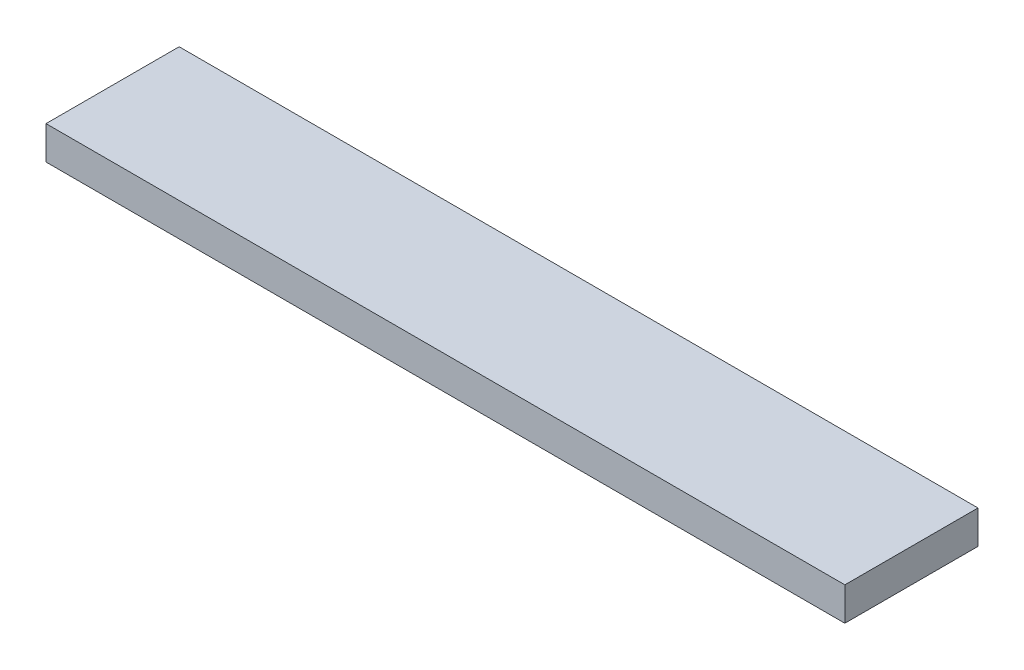
ISO-10303-21;
HEADER;
FILE_DESCRIPTION(('STEP AP214'),'2;1');
FILE_NAME('part.step','',(''),(''),'','','');
FILE_SCHEMA(('AUTOMOTIVE_DESIGN { 1 0 10303 214 1 1 1 1 }'));
ENDSEC;
DATA;
#1=APPLICATION_CONTEXT('core data for automotive mechanical design processes');
#2=APPLICATION_PROTOCOL_DEFINITION('international standard','automotive_design',2000,#1);
#3=PRODUCT_CONTEXT('',#1,'mechanical');
#4=PRODUCT('Part','Part','',(#3));
#5=PRODUCT_RELATED_PRODUCT_CATEGORY('part','',(#4));
#6=PRODUCT_DEFINITION_FORMATION('','',#4);
#7=PRODUCT_DEFINITION_CONTEXT('part definition',#1,'design');
#8=PRODUCT_DEFINITION('design','',#6,#7);
#9=PRODUCT_DEFINITION_SHAPE('','',#8);
#10=(LENGTH_UNIT() NAMED_UNIT(*) SI_UNIT(.MILLI.,.METRE.));
#11=(NAMED_UNIT(*) PLANE_ANGLE_UNIT() SI_UNIT($,.RADIAN.));
#12=(NAMED_UNIT(*) SI_UNIT($,.STERADIAN.) SOLID_ANGLE_UNIT());
#13=UNCERTAINTY_MEASURE_WITH_UNIT(LENGTH_MEASURE(1.E-05),#10,'distance_accuracy_value','');
#14=(GEOMETRIC_REPRESENTATION_CONTEXT(3) GLOBAL_UNCERTAINTY_ASSIGNED_CONTEXT((#13)) GLOBAL_UNIT_ASSIGNED_CONTEXT((#10,
#11,#12)) REPRESENTATION_CONTEXT('',''));
#15=CARTESIAN_POINT('',(0.,0.,0.));
#16=DIRECTION('',(0.,0.,1.));
#17=DIRECTION('',(1.,0.,0.));
#18=AXIS2_PLACEMENT_3D('',#15,#16,#17);
#19=CARTESIAN_POINT('',(0.,3.175,0.));
#20=DIRECTION('',(1.,0.,0.));
#21=DIRECTION('',(0.,0.,-1.));
#22=AXIS2_PLACEMENT_3D('',#19,#20,#21);
#23=PLANE('',#22);
#24=DIRECTION('',(0.,0.,1.));
#25=VECTOR('',#24,1.);
#26=CARTESIAN_POINT('',(0.,0.,0.));
#27=LINE('',#26,#25);
#28=CARTESIAN_POINT('',(0.,0.,0.));
#29=VERTEX_POINT('',#28);
#30=CARTESIAN_POINT('',(0.,0.,12.7));
#31=VERTEX_POINT('',#30);
#32=EDGE_CURVE('E96',#29,#31,#27,.T.);
#33=ORIENTED_EDGE('',*,*,#32,.T.);
#34=DIRECTION('',(0.,-1.,0.));
#35=VECTOR('',#34,1.);
#36=CARTESIAN_POINT('',(0.,3.175,12.7));
#37=LINE('',#36,#35);
#38=CARTESIAN_POINT('',(0.,3.175,12.7));
#39=VERTEX_POINT('',#38);
#40=EDGE_CURVE('E11',#39,#31,#37,.T.);
#41=ORIENTED_EDGE('',*,*,#40,.F.);
#42=DIRECTION('',(0.,0.,1.));
#43=VECTOR('',#42,1.);
#44=CARTESIAN_POINT('',(0.,3.175,0.));
#45=LINE('',#44,#43);
#46=CARTESIAN_POINT('',(0.,3.175,0.));
#47=VERTEX_POINT('',#46);
#48=EDGE_CURVE('E84',#47,#39,#45,.T.);
#49=ORIENTED_EDGE('',*,*,#48,.F.);
#50=DIRECTION('',(0.,-1.,0.));
#51=VECTOR('',#50,1.);
#52=CARTESIAN_POINT('',(0.,3.175,0.));
#53=LINE('',#52,#51);
#54=EDGE_CURVE('E92',#47,#29,#53,.T.);
#55=ORIENTED_EDGE('',*,*,#54,.T.);
#56=EDGE_LOOP('',(#33,#41,#49,#55));
#57=FACE_BOUND('',#56,.T.);
#58=ADVANCED_FACE('F33',(#57),#23,.F.);
#59=CARTESIAN_POINT('',(0.,3.175,12.7));
#60=DIRECTION('',(0.,0.,-1.));
#61=DIRECTION('',(-1.,0.,0.));
#62=AXIS2_PLACEMENT_3D('',#59,#60,#61);
#63=PLANE('',#62);
#64=DIRECTION('',(1.,0.,0.));
#65=VECTOR('',#64,1.);
#66=CARTESIAN_POINT('',(0.,0.,12.7));
#67=LINE('',#66,#65);
#68=CARTESIAN_POINT('',(76.2,0.,12.7));
#69=VERTEX_POINT('',#68);
#70=EDGE_CURVE('E88',#31,#69,#67,.T.);
#71=ORIENTED_EDGE('',*,*,#70,.T.);
#72=DIRECTION('',(0.,-1.,0.));
#73=VECTOR('',#72,1.);
#74=CARTESIAN_POINT('',(76.2,3.175,12.7));
#75=LINE('',#74,#73);
#76=CARTESIAN_POINT('',(76.2,3.175,12.7));
#77=VERTEX_POINT('',#76);
#78=EDGE_CURVE('E41',#77,#69,#75,.T.);
#79=ORIENTED_EDGE('',*,*,#78,.F.);
#80=DIRECTION('',(1.,0.,0.));
#81=VECTOR('',#80,1.);
#82=CARTESIAN_POINT('',(0.,3.175,12.7));
#83=LINE('',#82,#81);
#84=EDGE_CURVE('E79',#39,#77,#83,.T.);
#85=ORIENTED_EDGE('',*,*,#84,.F.);
#86=ORIENTED_EDGE('',*,*,#40,.T.);
#87=EDGE_LOOP('',(#71,#79,#85,#86));
#88=FACE_BOUND('',#87,.T.);
#89=ADVANCED_FACE('F87',(#88),#63,.F.);
#90=CARTESIAN_POINT('',(76.2,3.175,0.));
#91=DIRECTION('',(-1.,0.,0.));
#92=DIRECTION('',(0.,0.,1.));
#93=AXIS2_PLACEMENT_3D('',#90,#91,#92);
#94=PLANE('',#93);
#95=DIRECTION('',(0.,0.,-1.));
#96=VECTOR('',#95,1.);
#97=CARTESIAN_POINT('',(76.2,0.,0.));
#98=LINE('',#97,#96);
#99=CARTESIAN_POINT('',(76.2,0.,0.));
#100=VERTEX_POINT('',#99);
#101=EDGE_CURVE('E66',#69,#100,#98,.T.);
#102=ORIENTED_EDGE('',*,*,#101,.T.);
#103=DIRECTION('',(0.,-1.,0.));
#104=VECTOR('',#103,1.);
#105=CARTESIAN_POINT('',(76.2,3.175,0.));
#106=LINE('',#105,#104);
#107=CARTESIAN_POINT('',(76.2,3.175,0.));
#108=VERTEX_POINT('',#107);
#109=EDGE_CURVE('E89',#108,#100,#106,.T.);
#110=ORIENTED_EDGE('',*,*,#109,.F.);
#111=DIRECTION('',(0.,0.,-1.));
#112=VECTOR('',#111,1.);
#113=CARTESIAN_POINT('',(76.2,3.175,0.));
#114=LINE('',#113,#112);
#115=EDGE_CURVE('E82',#77,#108,#114,.T.);
#116=ORIENTED_EDGE('',*,*,#115,.F.);
#117=ORIENTED_EDGE('',*,*,#78,.T.);
#118=EDGE_LOOP('',(#102,#110,#116,#117));
#119=FACE_BOUND('',#118,.T.);
#120=ADVANCED_FACE('F90',(#119),#94,.F.);
#121=CARTESIAN_POINT('',(0.,3.175,0.));
#122=DIRECTION('',(0.,0.,1.));
#123=DIRECTION('',(1.,0.,0.));
#124=AXIS2_PLACEMENT_3D('',#121,#122,#123);
#125=PLANE('',#124);
#126=DIRECTION('',(-1.,0.,0.));
#127=VECTOR('',#126,1.);
#128=CARTESIAN_POINT('',(0.,0.,0.));
#129=LINE('',#128,#127);
#130=EDGE_CURVE('E72',#100,#29,#129,.T.);
#131=ORIENTED_EDGE('',*,*,#130,.T.);
#132=ORIENTED_EDGE('',*,*,#54,.F.);
#133=DIRECTION('',(-1.,0.,0.));
#134=VECTOR('',#133,1.);
#135=CARTESIAN_POINT('',(0.,3.175,0.));
#136=LINE('',#135,#134);
#137=EDGE_CURVE('E49',#108,#47,#136,.T.);
#138=ORIENTED_EDGE('',*,*,#137,.F.);
#139=ORIENTED_EDGE('',*,*,#109,.T.);
#140=EDGE_LOOP('',(#131,#132,#138,#139));
#141=FACE_BOUND('',#140,.T.);
#142=ADVANCED_FACE('F103',(#141),#125,.F.);
#143=CARTESIAN_POINT('',(0.,3.175,0.));
#144=DIRECTION('',(0.,1.,0.));
#145=DIRECTION('',(0.,0.,1.));
#146=AXIS2_PLACEMENT_3D('',#143,#144,#145);
#147=PLANE('',#146);
#148=ORIENTED_EDGE('',*,*,#48,.T.);
#149=ORIENTED_EDGE('',*,*,#84,.T.);
#150=ORIENTED_EDGE('',*,*,#115,.T.);
#151=ORIENTED_EDGE('',*,*,#137,.T.);
#152=EDGE_LOOP('',(#148,#149,#150,#151));
#153=FACE_BOUND('',#152,.T.);
#154=ADVANCED_FACE('F80',(#153),#147,.T.);
#155=CARTESIAN_POINT('',(0.,0.,0.));
#156=DIRECTION('',(0.,1.,0.));
#157=DIRECTION('',(0.,0.,1.));
#158=AXIS2_PLACEMENT_3D('',#155,#156,#157);
#159=PLANE('',#158);
#160=ORIENTED_EDGE('',*,*,#32,.F.);
#161=ORIENTED_EDGE('',*,*,#130,.F.);
#162=ORIENTED_EDGE('',*,*,#101,.F.);
#163=ORIENTED_EDGE('',*,*,#70,.F.);
#164=EDGE_LOOP('',(#160,#161,#162,#163));
#165=FACE_BOUND('',#164,.T.);
#166=ADVANCED_FACE('F106',(#165),#159,.F.);
#167=CLOSED_SHELL('',(#58,#89,#120,#142,#154,#166));
#168=MANIFOLD_SOLID_BREP('B2',#167);
#169=ADVANCED_BREP_SHAPE_REPRESENTATION('',(#18,#168),#14);
#170=SHAPE_DEFINITION_REPRESENTATION(#9,#169);
ENDSEC;
END-ISO-10303-21;
